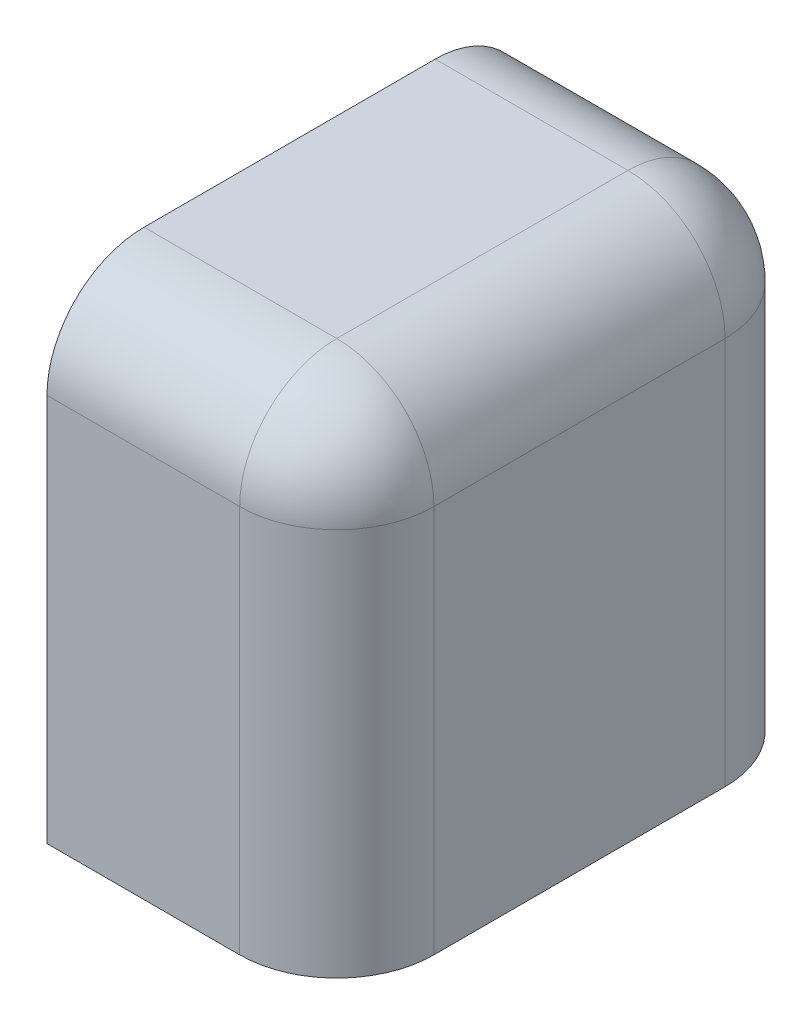
ISO-10303-21;
HEADER;
FILE_DESCRIPTION(('STEP AP214'),'2;1');
FILE_NAME('part.step','',(''),(''),'','','');
FILE_SCHEMA(('AUTOMOTIVE_DESIGN { 1 0 10303 214 1 1 1 1 }'));
ENDSEC;
DATA;
#1=APPLICATION_CONTEXT('core data for automotive mechanical design processes');
#2=APPLICATION_PROTOCOL_DEFINITION('international standard','automotive_design',2000,#1);
#3=PRODUCT_CONTEXT('',#1,'mechanical');
#4=PRODUCT('Part','Part','',(#3));
#5=PRODUCT_RELATED_PRODUCT_CATEGORY('part','',(#4));
#6=PRODUCT_DEFINITION_FORMATION('','',#4);
#7=PRODUCT_DEFINITION_CONTEXT('part definition',#1,'design');
#8=PRODUCT_DEFINITION('design','',#6,#7);
#9=PRODUCT_DEFINITION_SHAPE('','',#8);
#10=(LENGTH_UNIT() NAMED_UNIT(*) SI_UNIT(.MILLI.,.METRE.));
#11=(NAMED_UNIT(*) PLANE_ANGLE_UNIT() SI_UNIT($,.RADIAN.));
#12=(NAMED_UNIT(*) SI_UNIT($,.STERADIAN.) SOLID_ANGLE_UNIT());
#13=UNCERTAINTY_MEASURE_WITH_UNIT(LENGTH_MEASURE(1.E-05),#10,'distance_accuracy_value','');
#14=(GEOMETRIC_REPRESENTATION_CONTEXT(3) GLOBAL_UNCERTAINTY_ASSIGNED_CONTEXT((#13)) GLOBAL_UNIT_ASSIGNED_CONTEXT((#10,
#11,#12)) REPRESENTATION_CONTEXT('',''));
#15=CARTESIAN_POINT('',(0.,0.,0.));
#16=DIRECTION('',(0.,0.,1.));
#17=DIRECTION('',(1.,0.,0.));
#18=AXIS2_PLACEMENT_3D('',#15,#16,#17);
#19=CARTESIAN_POINT('',(-1.8036,0.4,0.15));
#20=DIRECTION('',(1.,0.,0.));
#21=DIRECTION('',(0.,-0.707106781186547,-0.707106781186548));
#22=AXIS2_PLACEMENT_3D('',#19,#20,#21);
#23=CYLINDRICAL_SURFACE('',#22,0.1);
#24=DIRECTION('',(1.,0.,0.));
#25=VECTOR('',#24,1.);
#26=CARTESIAN_POINT('',(0.2014,0.4,0.25));
#27=LINE('',#26,#25);
#28=CARTESIAN_POINT('',(0.2014,0.4,0.25));
#29=VERTEX_POINT('',#28);
#30=CARTESIAN_POINT('',(0.4,0.4,0.25));
#31=VERTEX_POINT('',#30);
#32=EDGE_CURVE('E10',#29,#31,#27,.T.);
#33=ORIENTED_EDGE('',*,*,#32,.T.);
#34=CARTESIAN_POINT('',(0.4,0.4,0.15));
#35=DIRECTION('',(1.,0.,0.));
#36=DIRECTION('',(0.,1.,0.));
#37=AXIS2_PLACEMENT_3D('',#34,#35,#36);
#38=CIRCLE('',#37,0.1);
#39=CARTESIAN_POINT('',(0.4,0.5,0.15));
#40=VERTEX_POINT('',#39);
#41=EDGE_CURVE('E24',#40,#31,#38,.T.);
#42=ORIENTED_EDGE('',*,*,#41,.F.);
#43=DIRECTION('',(1.,0.,0.));
#44=VECTOR('',#43,1.);
#45=CARTESIAN_POINT('',(0.2014,0.5,0.15));
#46=LINE('',#45,#44);
#47=CARTESIAN_POINT('',(0.2014,0.5,0.15));
#48=VERTEX_POINT('',#47);
#49=EDGE_CURVE('E200',#48,#40,#46,.T.);
#50=ORIENTED_EDGE('',*,*,#49,.F.);
#51=CARTESIAN_POINT('',(0.2014,0.4,0.15));
#52=DIRECTION('',(-1.,0.,0.));
#53=DIRECTION('',(0.,0.,1.));
#54=AXIS2_PLACEMENT_3D('',#51,#52,#53);
#55=CIRCLE('',#54,0.1);
#56=EDGE_CURVE('E195',#29,#48,#55,.T.);
#57=ORIENTED_EDGE('',*,*,#56,.F.);
#58=EDGE_LOOP('',(#33,#42,#50,#57));
#59=FACE_BOUND('',#58,.T.);
#60=ADVANCED_FACE('F16',(#59),#23,.T.);
#61=CARTESIAN_POINT('',(0.2014,0.,0.3514));
#62=DIRECTION('',(1.,0.,0.));
#63=DIRECTION('',(0.,0.,-1.));
#64=AXIS2_PLACEMENT_3D('',#61,#62,#63);
#65=PLANE('',#64);
#66=DIRECTION('',(0.,1.,0.));
#67=VECTOR('',#66,1.);
#68=CARTESIAN_POINT('',(0.2014,0.,-0.25));
#69=LINE('',#68,#67);
#70=CARTESIAN_POINT('',(0.2014,0.,-0.25));
#71=VERTEX_POINT('',#70);
#72=CARTESIAN_POINT('',(0.2014,0.4,-0.25));
#73=VERTEX_POINT('',#72);
#74=EDGE_CURVE('E190',#71,#73,#69,.T.);
#75=ORIENTED_EDGE('',*,*,#74,.F.);
#76=DIRECTION('',(0.,0.,-1.));
#77=VECTOR('',#76,1.);
#78=CARTESIAN_POINT('',(0.2014,0.,0.25));
#79=LINE('',#78,#77);
#80=CARTESIAN_POINT('',(0.2014,0.,0.25));
#81=VERTEX_POINT('',#80);
#82=EDGE_CURVE('E185',#81,#71,#79,.T.);
#83=ORIENTED_EDGE('',*,*,#82,.F.);
#84=DIRECTION('',(0.,1.,0.));
#85=VECTOR('',#84,1.);
#86=CARTESIAN_POINT('',(0.2014,0.,0.25));
#87=LINE('',#86,#85);
#88=EDGE_CURVE('E180',#81,#29,#87,.T.);
#89=ORIENTED_EDGE('',*,*,#88,.T.);
#90=ORIENTED_EDGE('',*,*,#56,.T.);
#91=DIRECTION('',(0.,0.,-1.));
#92=VECTOR('',#91,1.);
#93=CARTESIAN_POINT('',(0.2014,0.5,0.15));
#94=LINE('',#93,#92);
#95=CARTESIAN_POINT('',(0.2014,0.5,-0.15));
#96=VERTEX_POINT('',#95);
#97=EDGE_CURVE('E176',#48,#96,#94,.T.);
#98=ORIENTED_EDGE('',*,*,#97,.T.);
#99=CARTESIAN_POINT('',(0.2014,0.4,-0.15));
#100=DIRECTION('',(-1.,0.,0.));
#101=DIRECTION('',(0.,1.,0.));
#102=AXIS2_PLACEMENT_3D('',#99,#100,#101);
#103=CIRCLE('',#102,0.1);
#104=EDGE_CURVE('E172',#96,#73,#103,.T.);
#105=ORIENTED_EDGE('',*,*,#104,.T.);
#106=EDGE_LOOP('',(#75,#83,#89,#90,#98,#105));
#107=FACE_BOUND('',#106,.T.);
#108=ADVANCED_FACE('F228',(#107),#65,.F.);
#109=CARTESIAN_POINT('',(0.40189102071,0.4,-0.15));
#110=DIRECTION('',(-1.,0.,0.));
#111=DIRECTION('',(0.,-0.707106781186547,0.707106781186548));
#112=AXIS2_PLACEMENT_3D('',#109,#110,#111);
#113=CYLINDRICAL_SURFACE('',#112,0.1);
#114=DIRECTION('',(-1.,0.,0.));
#115=VECTOR('',#114,1.);
#116=CARTESIAN_POINT('',(0.4,0.5,-0.15));
#117=LINE('',#116,#115);
#118=CARTESIAN_POINT('',(0.4,0.5,-0.15));
#119=VERTEX_POINT('',#118);
#120=EDGE_CURVE('E167',#119,#96,#117,.T.);
#121=ORIENTED_EDGE('',*,*,#120,.F.);
#122=CARTESIAN_POINT('',(0.4,0.4,-0.15));
#123=DIRECTION('',(-1.,0.,0.));
#124=DIRECTION('',(0.,1.,0.));
#125=AXIS2_PLACEMENT_3D('',#122,#123,#124);
#126=CIRCLE('',#125,0.1);
#127=CARTESIAN_POINT('',(0.399999999999,0.4,-0.25));
#128=VERTEX_POINT('',#127);
#129=EDGE_CURVE('E110',#119,#128,#126,.T.);
#130=ORIENTED_EDGE('',*,*,#129,.T.);
#131=DIRECTION('',(-1.,0.,0.));
#132=VECTOR('',#131,1.);
#133=CARTESIAN_POINT('',(0.399999999999,0.4,-0.25));
#134=LINE('',#133,#132);
#135=EDGE_CURVE('E159',#128,#73,#134,.T.);
#136=ORIENTED_EDGE('',*,*,#135,.T.);
#137=ORIENTED_EDGE('',*,*,#104,.F.);
#138=EDGE_LOOP('',(#121,#130,#136,#137));
#139=FACE_BOUND('',#138,.T.);
#140=ADVANCED_FACE('F223',(#139),#113,.T.);
#141=CARTESIAN_POINT('',(0.5,0.,-0.25));
#142=DIRECTION('',(0.,0.,-1.));
#143=DIRECTION('',(-1.,0.,0.));
#144=AXIS2_PLACEMENT_3D('',#141,#142,#143);
#145=PLANE('',#144);
#146=DIRECTION('',(1.623423617758E-12,-1.,0.));
#147=VECTOR('',#146,1.);
#148=CARTESIAN_POINT('',(0.399999999999,0.4,-0.25));
#149=LINE('',#148,#147);
#150=CARTESIAN_POINT('',(0.4,0.,-0.25));
#151=VERTEX_POINT('',#150);
#152=EDGE_CURVE('E104',#128,#151,#149,.T.);
#153=ORIENTED_EDGE('',*,*,#152,.T.);
#154=DIRECTION('',(-1.,0.,0.));
#155=VECTOR('',#154,1.);
#156=CARTESIAN_POINT('',(0.4,0.,-0.25));
#157=LINE('',#156,#155);
#158=EDGE_CURVE('E151',#151,#71,#157,.T.);
#159=ORIENTED_EDGE('',*,*,#158,.T.);
#160=ORIENTED_EDGE('',*,*,#74,.T.);
#161=ORIENTED_EDGE('',*,*,#135,.F.);
#162=EDGE_LOOP('',(#153,#159,#160,#161));
#163=FACE_BOUND('',#162,.T.);
#164=ADVANCED_FACE('F220',(#163),#145,.T.);
#165=CARTESIAN_POINT('',(0.,0.,0.));
#166=DIRECTION('',(0.,1.,0.));
#167=DIRECTION('',(1.,0.,0.));
#168=AXIS2_PLACEMENT_3D('',#165,#166,#167);
#169=PLANE('',#168);
#170=DIRECTION('',(1.,0.,0.));
#171=VECTOR('',#170,1.);
#172=CARTESIAN_POINT('',(0.2014,0.,0.25));
#173=LINE('',#172,#171);
#174=CARTESIAN_POINT('',(0.4,0.,0.25));
#175=VERTEX_POINT('',#174);
#176=EDGE_CURVE('E146',#81,#175,#173,.T.);
#177=ORIENTED_EDGE('',*,*,#176,.F.);
#178=ORIENTED_EDGE('',*,*,#82,.T.);
#179=ORIENTED_EDGE('',*,*,#158,.F.);
#180=CARTESIAN_POINT('',(0.4,0.,-0.15));
#181=DIRECTION('',(0.,-1.,0.));
#182=DIRECTION('',(0.,0.,-1.));
#183=AXIS2_PLACEMENT_3D('',#180,#181,#182);
#184=CIRCLE('',#183,0.1);
#185=CARTESIAN_POINT('',(0.5,0.,-0.15));
#186=VERTEX_POINT('',#185);
#187=EDGE_CURVE('E142',#151,#186,#184,.T.);
#188=ORIENTED_EDGE('',*,*,#187,.T.);
#189=DIRECTION('',(0.,0.,-1.));
#190=VECTOR('',#189,1.);
#191=CARTESIAN_POINT('',(0.5,0.,0.15));
#192=LINE('',#191,#190);
#193=CARTESIAN_POINT('',(0.5,0.,0.15));
#194=VERTEX_POINT('',#193);
#195=EDGE_CURVE('E96',#194,#186,#192,.T.);
#196=ORIENTED_EDGE('',*,*,#195,.F.);
#197=CARTESIAN_POINT('',(0.4,0.,0.15));
#198=DIRECTION('',(0.,-1.,0.));
#199=DIRECTION('',(1.,0.,0.));
#200=AXIS2_PLACEMENT_3D('',#197,#198,#199);
#201=CIRCLE('',#200,0.1);
#202=EDGE_CURVE('E135',#194,#175,#201,.T.);
#203=ORIENTED_EDGE('',*,*,#202,.T.);
#204=EDGE_LOOP('',(#177,#178,#179,#188,#196,#203));
#205=FACE_BOUND('',#204,.T.);
#206=ADVANCED_FACE('F216',(#205),#169,.F.);
#207=CARTESIAN_POINT('',(0.4,1.1518,0.15));
#208=DIRECTION('',(0.,-1.,0.));
#209=DIRECTION('',(-0.707106781179476,0.,-0.707106781193619));
#210=AXIS2_PLACEMENT_3D('',#207,#208,#209);
#211=CYLINDRICAL_SURFACE('',#210,0.1);
#212=DIRECTION('',(8.57133808374E-12,-1.,0.));
#213=VECTOR('',#212,1.);
#214=CARTESIAN_POINT('',(0.399999999997,0.4,0.25));
#215=LINE('',#214,#213);
#216=EDGE_CURVE('E130',#31,#175,#215,.T.);
#217=ORIENTED_EDGE('',*,*,#216,.T.);
#218=ORIENTED_EDGE('',*,*,#202,.F.);
#219=DIRECTION('',(0.,-1.,1.623701173514E-12));
#220=VECTOR('',#219,1.);
#221=CARTESIAN_POINT('',(0.5,0.4,0.149999999999));
#222=LINE('',#221,#220);
#223=CARTESIAN_POINT('',(0.5,0.4,0.149999999999));
#224=VERTEX_POINT('',#223);
#225=EDGE_CURVE('E126',#224,#194,#222,.T.);
#226=ORIENTED_EDGE('',*,*,#225,.F.);
#227=CARTESIAN_POINT('',(0.4,0.4,0.15));
#228=DIRECTION('',(0.,1.,0.));
#229=DIRECTION('',(0.,0.,1.));
#230=AXIS2_PLACEMENT_3D('',#227,#228,#229);
#231=CIRCLE('',#230,0.1);
#232=EDGE_CURVE('E122',#31,#224,#231,.T.);
#233=ORIENTED_EDGE('',*,*,#232,.F.);
#234=EDGE_LOOP('',(#217,#218,#226,#233));
#235=FACE_BOUND('',#234,.T.);
#236=ADVANCED_FACE('F212',(#235),#211,.T.);
#237=CARTESIAN_POINT('',(0.4,0.4,0.15));
#238=DIRECTION('',(-0.707106781202048,0.,0.707106781171048));
#239=DIRECTION('',(-0.49999999998904,-0.707106781186548,-0.50000000001096));
#240=AXIS2_PLACEMENT_3D('',#237,#238,#239);
#241=SPHERICAL_SURFACE('',#240,0.1);
#242=CARTESIAN_POINT('',(0.4,0.4,0.15));
#243=DIRECTION('',(0.,0.,-1.));
#244=DIRECTION('',(0.,1.,0.));
#245=AXIS2_PLACEMENT_3D('',#242,#243,#244);
#246=CIRCLE('',#245,0.1);
#247=EDGE_CURVE('E86',#40,#224,#246,.T.);
#248=ORIENTED_EDGE('',*,*,#247,.F.);
#249=ORIENTED_EDGE('',*,*,#41,.T.);
#250=ORIENTED_EDGE('',*,*,#232,.T.);
#251=EDGE_LOOP('',(#248,#249,#250));
#252=FACE_BOUND('',#251,.T.);
#253=ADVANCED_FACE('F209',(#252),#241,.T.);
#254=CARTESIAN_POINT('',(0.4,0.4,0.15189102071));
#255=DIRECTION('',(0.,0.,-1.));
#256=DIRECTION('',(-0.707106781186548,-0.707106781186547,0.));
#257=AXIS2_PLACEMENT_3D('',#254,#255,#256);
#258=CYLINDRICAL_SURFACE('',#257,0.1);
#259=ORIENTED_EDGE('',*,*,#247,.T.);
#260=DIRECTION('',(0.,0.,-1.));
#261=VECTOR('',#260,1.);
#262=CARTESIAN_POINT('',(0.5,0.4,0.149999999999));
#263=LINE('',#262,#261);
#264=CARTESIAN_POINT('',(0.5,0.4,-0.15));
#265=VERTEX_POINT('',#264);
#266=EDGE_CURVE('E78',#224,#265,#263,.T.);
#267=ORIENTED_EDGE('',*,*,#266,.T.);
#268=CARTESIAN_POINT('',(0.4,0.4,-0.15));
#269=DIRECTION('',(0.,0.,-1.));
#270=DIRECTION('',(0.,1.,0.));
#271=AXIS2_PLACEMENT_3D('',#268,#269,#270);
#272=CIRCLE('',#271,0.1);
#273=EDGE_CURVE('E83',#119,#265,#272,.T.);
#274=ORIENTED_EDGE('',*,*,#273,.F.);
#275=DIRECTION('',(0.,0.,-1.));
#276=VECTOR('',#275,1.);
#277=CARTESIAN_POINT('',(0.4,0.5,0.15));
#278=LINE('',#277,#276);
#279=EDGE_CURVE('E107',#40,#119,#278,.T.);
#280=ORIENTED_EDGE('',*,*,#279,.F.);
#281=EDGE_LOOP('',(#259,#267,#274,#280));
#282=FACE_BOUND('',#281,.T.);
#283=ADVANCED_FACE('F80',(#282),#258,.T.);
#284=CARTESIAN_POINT('',(0.,0.5,0.));
#285=DIRECTION('',(0.,1.,0.));
#286=DIRECTION('',(1.,0.,0.));
#287=AXIS2_PLACEMENT_3D('',#284,#285,#286);
#288=PLANE('',#287);
#289=ORIENTED_EDGE('',*,*,#97,.F.);
#290=ORIENTED_EDGE('',*,*,#49,.T.);
#291=ORIENTED_EDGE('',*,*,#279,.T.);
#292=ORIENTED_EDGE('',*,*,#120,.T.);
#293=EDGE_LOOP('',(#289,#290,#291,#292));
#294=FACE_BOUND('',#293,.T.);
#295=ADVANCED_FACE('F226',(#294),#288,.T.);
#296=CARTESIAN_POINT('',(0.4,0.4,-0.15));
#297=DIRECTION('',(0.707106781171048,0.,0.707106781202048));
#298=DIRECTION('',(-0.50000000001096,-0.707106781186548,0.49999999998904));
#299=AXIS2_PLACEMENT_3D('',#296,#297,#298);
#300=SPHERICAL_SURFACE('',#299,0.1);
#301=ORIENTED_EDGE('',*,*,#129,.F.);
#302=ORIENTED_EDGE('',*,*,#273,.T.);
#303=CARTESIAN_POINT('',(0.4,0.4,-0.15));
#304=DIRECTION('',(0.,1.,0.));
#305=DIRECTION('',(1.,0.,0.));
#306=AXIS2_PLACEMENT_3D('',#303,#304,#305);
#307=CIRCLE('',#306,0.1);
#308=EDGE_CURVE('E99',#265,#128,#307,.T.);
#309=ORIENTED_EDGE('',*,*,#308,.T.);
#310=EDGE_LOOP('',(#301,#302,#309));
#311=FACE_BOUND('',#310,.T.);
#312=ADVANCED_FACE('F109',(#311),#300,.T.);
#313=CARTESIAN_POINT('',(0.4,1.1518,-0.15));
#314=DIRECTION('',(0.,-1.,0.));
#315=DIRECTION('',(-0.707106781193619,0.,0.707106781179476));
#316=AXIS2_PLACEMENT_3D('',#313,#314,#315);
#317=CYLINDRICAL_SURFACE('',#316,0.1);
#318=DIRECTION('',(0.,-1.,-8.57133808374E-12));
#319=VECTOR('',#318,1.);
#320=CARTESIAN_POINT('',(0.5,0.4,-0.149999999997));
#321=LINE('',#320,#319);
#322=EDGE_CURVE('E93',#265,#186,#321,.T.);
#323=ORIENTED_EDGE('',*,*,#322,.T.);
#324=ORIENTED_EDGE('',*,*,#187,.F.);
#325=ORIENTED_EDGE('',*,*,#152,.F.);
#326=ORIENTED_EDGE('',*,*,#308,.F.);
#327=EDGE_LOOP('',(#323,#324,#325,#326));
#328=FACE_BOUND('',#327,.T.);
#329=ADVANCED_FACE('F103',(#328),#317,.T.);
#330=CARTESIAN_POINT('',(0.5,0.,0.25));
#331=DIRECTION('',(1.,0.,0.));
#332=DIRECTION('',(0.,0.,-1.));
#333=AXIS2_PLACEMENT_3D('',#330,#331,#332);
#334=PLANE('',#333);
#335=ORIENTED_EDGE('',*,*,#225,.T.);
#336=ORIENTED_EDGE('',*,*,#195,.T.);
#337=ORIENTED_EDGE('',*,*,#322,.F.);
#338=ORIENTED_EDGE('',*,*,#266,.F.);
#339=EDGE_LOOP('',(#335,#336,#337,#338));
#340=FACE_BOUND('',#339,.T.);
#341=ADVANCED_FACE('F95',(#340),#334,.T.);
#342=CARTESIAN_POINT('',(-0.5,0.,0.25));
#343=DIRECTION('',(0.,0.,1.));
#344=DIRECTION('',(1.,0.,0.));
#345=AXIS2_PLACEMENT_3D('',#342,#343,#344);
#346=PLANE('',#345);
#347=ORIENTED_EDGE('',*,*,#88,.F.);
#348=ORIENTED_EDGE('',*,*,#176,.T.);
#349=ORIENTED_EDGE('',*,*,#216,.F.);
#350=ORIENTED_EDGE('',*,*,#32,.F.);
#351=EDGE_LOOP('',(#347,#348,#349,#350));
#352=FACE_BOUND('',#351,.T.);
#353=ADVANCED_FACE('F230',(#352),#346,.T.);
#354=CLOSED_SHELL('',(#60,#108,#140,#164,#206,#236,#253,#283,#295,#312,#329,#341,#353));
#355=MANIFOLD_SOLID_BREP('B1',#354);
#356=ADVANCED_BREP_SHAPE_REPRESENTATION('',(#18,#355),#14);
#357=SHAPE_DEFINITION_REPRESENTATION(#9,#356);
ENDSEC;
END-ISO-10303-21;
